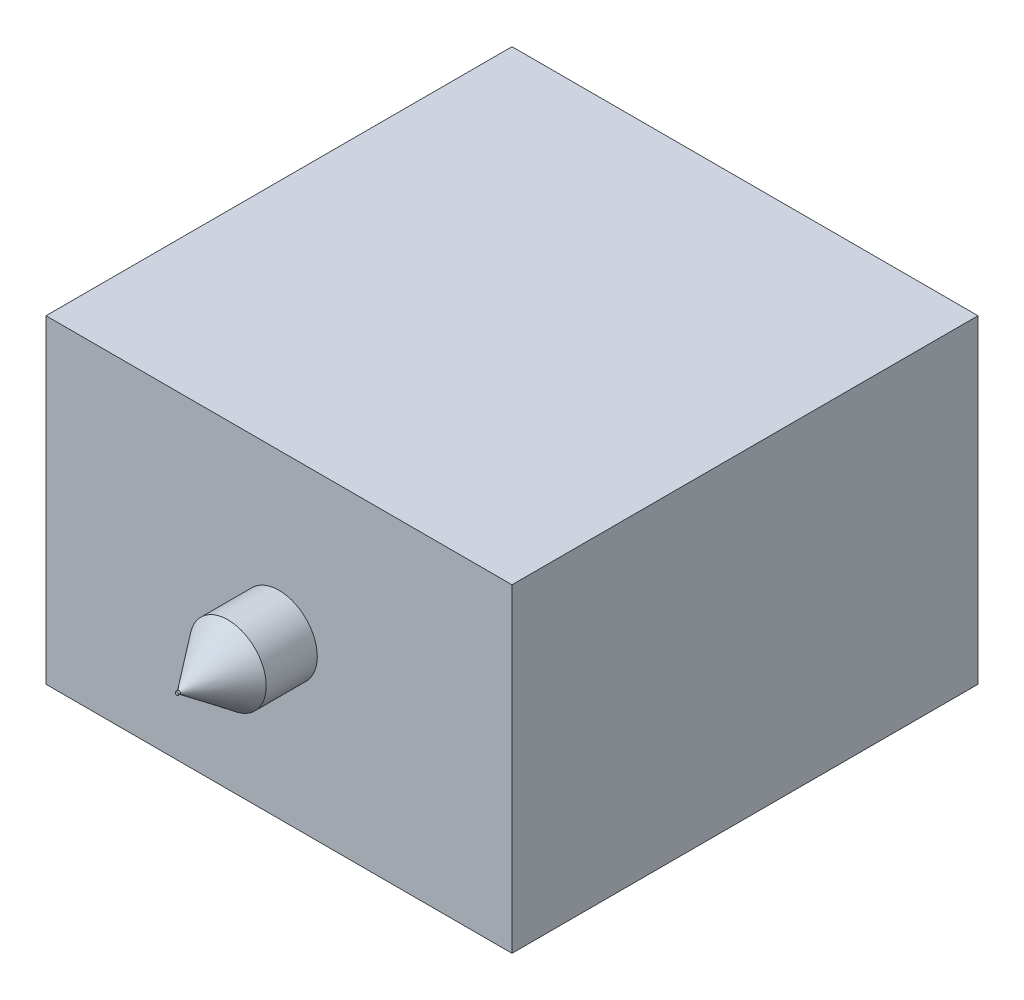
ISO-10303-21;
HEADER;
FILE_DESCRIPTION(('STEP AP214'),'2;1');
FILE_NAME('part.step','',(''),(''),'','','');
FILE_SCHEMA(('AUTOMOTIVE_DESIGN { 1 0 10303 214 1 1 1 1 }'));
ENDSEC;
DATA;
#1=APPLICATION_CONTEXT('core data for automotive mechanical design processes');
#2=APPLICATION_PROTOCOL_DEFINITION('international standard','automotive_design',2000,#1);
#3=PRODUCT_CONTEXT('',#1,'mechanical');
#4=PRODUCT('Part','Part','',(#3));
#5=PRODUCT_RELATED_PRODUCT_CATEGORY('part','',(#4));
#6=PRODUCT_DEFINITION_FORMATION('','',#4);
#7=PRODUCT_DEFINITION_CONTEXT('part definition',#1,'design');
#8=PRODUCT_DEFINITION('design','',#6,#7);
#9=PRODUCT_DEFINITION_SHAPE('','',#8);
#10=(LENGTH_UNIT() NAMED_UNIT(*) SI_UNIT(.MILLI.,.METRE.));
#11=(NAMED_UNIT(*) PLANE_ANGLE_UNIT() SI_UNIT($,.RADIAN.));
#12=(NAMED_UNIT(*) SI_UNIT($,.STERADIAN.) SOLID_ANGLE_UNIT());
#13=UNCERTAINTY_MEASURE_WITH_UNIT(LENGTH_MEASURE(1.E-05),#10,'distance_accuracy_value','');
#14=(GEOMETRIC_REPRESENTATION_CONTEXT(3) GLOBAL_UNCERTAINTY_ASSIGNED_CONTEXT((#13)) GLOBAL_UNIT_ASSIGNED_CONTEXT((#10,
#11,#12)) REPRESENTATION_CONTEXT('',''));
#15=CARTESIAN_POINT('',(0.,0.,0.));
#16=DIRECTION('',(0.,0.,1.));
#17=DIRECTION('',(1.,0.,0.));
#18=AXIS2_PLACEMENT_3D('',#15,#16,#17);
#19=CARTESIAN_POINT('',(0.,0.,457.2));
#20=DIRECTION('',(1.,0.,0.));
#21=DIRECTION('',(0.,0.,-1.));
#22=AXIS2_PLACEMENT_3D('',#19,#20,#21);
#23=PLANE('',#22);
#24=DIRECTION('',(0.,-1.,0.));
#25=VECTOR('',#24,1.);
#26=CARTESIAN_POINT('',(0.,0.,0.));
#27=LINE('',#26,#25);
#28=CARTESIAN_POINT('',(0.,311.15,0.));
#29=VERTEX_POINT('',#28);
#30=CARTESIAN_POINT('',(0.,-6.35,0.));
#31=VERTEX_POINT('',#30);
#32=EDGE_CURVE('E61',#29,#31,#27,.T.);
#33=ORIENTED_EDGE('',*,*,#32,.T.);
#34=DIRECTION('',(0.,0.,-1.));
#35=VECTOR('',#34,1.);
#36=CARTESIAN_POINT('',(0.,-6.35,0.));
#37=LINE('',#36,#35);
#38=CARTESIAN_POINT('',(0.,-6.35,463.55));
#39=VERTEX_POINT('',#38);
#40=EDGE_CURVE('E100',#39,#31,#37,.T.);
#41=ORIENTED_EDGE('',*,*,#40,.F.);
#42=DIRECTION('',(0.,-1.,0.));
#43=VECTOR('',#42,1.);
#44=CARTESIAN_POINT('',(0.,311.15,463.55));
#45=LINE('',#44,#43);
#46=CARTESIAN_POINT('',(0.,311.15,463.55));
#47=VERTEX_POINT('',#46);
#48=EDGE_CURVE('E98',#47,#39,#45,.T.);
#49=ORIENTED_EDGE('',*,*,#48,.F.);
#50=DIRECTION('',(0.,0.,1.));
#51=VECTOR('',#50,1.);
#52=CARTESIAN_POINT('',(0.,311.15,0.));
#53=LINE('',#52,#51);
#54=EDGE_CURVE('E85',#29,#47,#53,.T.);
#55=ORIENTED_EDGE('',*,*,#54,.F.);
#56=EDGE_LOOP('',(#33,#41,#49,#55));
#57=FACE_BOUND('',#56,.T.);
#58=ADVANCED_FACE('F43',(#57),#23,.F.);
#59=CARTESIAN_POINT('',(0.,0.,0.));
#60=DIRECTION('',(0.,0.,-1.));
#61=DIRECTION('',(-1.,0.,0.));
#62=AXIS2_PLACEMENT_3D('',#59,#60,#61);
#63=PLANE('',#62);
#64=CARTESIAN_POINT('',(231.775,152.4,0.));
#65=DIRECTION('',(0.,0.,-1.));
#66=DIRECTION('',(-1.,0.,0.));
#67=AXIS2_PLACEMENT_3D('',#64,#65,#66);
#68=CIRCLE('',#67,50.8);
#69=CARTESIAN_POINT('',(180.975,152.4,0.));
#70=VERTEX_POINT('',#69);
#71=EDGE_CURVE('E51',#70,#70,#68,.T.);
#72=ORIENTED_EDGE('',*,*,#71,.F.);
#73=EDGE_LOOP('',(#72));
#74=FACE_BOUND('',#73,.T.);
#75=ORIENTED_EDGE('',*,*,#32,.F.);
#76=DIRECTION('',(-1.,0.,0.));
#77=VECTOR('',#76,1.);
#78=CARTESIAN_POINT('',(0.,311.15,0.));
#79=LINE('',#78,#77);
#80=CARTESIAN_POINT('',(463.55,311.15,0.));
#81=VERTEX_POINT('',#80);
#82=EDGE_CURVE('E91',#81,#29,#79,.T.);
#83=ORIENTED_EDGE('',*,*,#82,.F.);
#84=DIRECTION('',(0.,1.,0.));
#85=VECTOR('',#84,1.);
#86=CARTESIAN_POINT('',(463.55,0.,0.));
#87=LINE('',#86,#85);
#88=CARTESIAN_POINT('',(463.55,-6.35,0.));
#89=VERTEX_POINT('',#88);
#90=EDGE_CURVE('E136',#89,#81,#87,.T.);
#91=ORIENTED_EDGE('',*,*,#90,.F.);
#92=DIRECTION('',(1.,0.,0.));
#93=VECTOR('',#92,1.);
#94=CARTESIAN_POINT('',(0.,-6.35,0.));
#95=LINE('',#94,#93);
#96=EDGE_CURVE('E126',#31,#89,#95,.T.);
#97=ORIENTED_EDGE('',*,*,#96,.F.);
#98=EDGE_LOOP('',(#75,#83,#91,#97));
#99=FACE_BOUND('',#98,.T.);
#100=ADVANCED_FACE('F176',(#74,#99),#63,.T.);
#101=CARTESIAN_POINT('',(463.55,0.,0.));
#102=DIRECTION('',(1.,0.,0.));
#103=DIRECTION('',(0.,0.,-1.));
#104=AXIS2_PLACEMENT_3D('',#101,#102,#103);
#105=PLANE('',#104);
#106=ORIENTED_EDGE('',*,*,#90,.T.);
#107=DIRECTION('',(0.,0.,-1.));
#108=VECTOR('',#107,1.);
#109=CARTESIAN_POINT('',(463.55,311.15,0.));
#110=LINE('',#109,#108);
#111=CARTESIAN_POINT('',(463.55,311.15,463.55));
#112=VERTEX_POINT('',#111);
#113=EDGE_CURVE('E94',#112,#81,#110,.T.);
#114=ORIENTED_EDGE('',*,*,#113,.F.);
#115=DIRECTION('',(0.,1.,0.));
#116=VECTOR('',#115,1.);
#117=CARTESIAN_POINT('',(463.55,-6.35,463.55));
#118=LINE('',#117,#116);
#119=CARTESIAN_POINT('',(463.55,-6.35,463.55));
#120=VERTEX_POINT('',#119);
#121=EDGE_CURVE('E110',#120,#112,#118,.T.);
#122=ORIENTED_EDGE('',*,*,#121,.F.);
#123=DIRECTION('',(0.,0.,1.));
#124=VECTOR('',#123,1.);
#125=CARTESIAN_POINT('',(463.55,-6.35,0.));
#126=LINE('',#125,#124);
#127=EDGE_CURVE('E95',#89,#120,#126,.T.);
#128=ORIENTED_EDGE('',*,*,#127,.F.);
#129=EDGE_LOOP('',(#106,#114,#122,#128));
#130=FACE_BOUND('',#129,.T.);
#131=ADVANCED_FACE('F180',(#130),#105,.T.);
#132=CARTESIAN_POINT('',(0.,311.15,0.));
#133=DIRECTION('',(0.,1.,0.));
#134=DIRECTION('',(0.,0.,1.));
#135=AXIS2_PLACEMENT_3D('',#132,#133,#134);
#136=PLANE('',#135);
#137=ORIENTED_EDGE('',*,*,#54,.T.);
#138=DIRECTION('',(-1.,0.,0.));
#139=VECTOR('',#138,1.);
#140=CARTESIAN_POINT('',(463.55,311.15,463.55));
#141=LINE('',#140,#139);
#142=EDGE_CURVE('E90',#112,#47,#141,.T.);
#143=ORIENTED_EDGE('',*,*,#142,.F.);
#144=ORIENTED_EDGE('',*,*,#113,.T.);
#145=ORIENTED_EDGE('',*,*,#82,.T.);
#146=EDGE_LOOP('',(#137,#143,#144,#145));
#147=FACE_BOUND('',#146,.T.);
#148=ADVANCED_FACE('F87',(#147),#136,.T.);
#149=CARTESIAN_POINT('',(0.,-6.35,0.));
#150=DIRECTION('',(0.,1.,0.));
#151=DIRECTION('',(0.,0.,1.));
#152=AXIS2_PLACEMENT_3D('',#149,#150,#151);
#153=PLANE('',#152);
#154=ORIENTED_EDGE('',*,*,#40,.T.);
#155=ORIENTED_EDGE('',*,*,#96,.T.);
#156=ORIENTED_EDGE('',*,*,#127,.T.);
#157=DIRECTION('',(1.,0.,0.));
#158=VECTOR('',#157,1.);
#159=CARTESIAN_POINT('',(0.,-6.35,463.55));
#160=LINE('',#159,#158);
#161=EDGE_CURVE('E105',#39,#120,#160,.T.);
#162=ORIENTED_EDGE('',*,*,#161,.F.);
#163=EDGE_LOOP('',(#154,#155,#156,#162));
#164=FACE_BOUND('',#163,.T.);
#165=ADVANCED_FACE('F190',(#164),#153,.F.);
#166=CARTESIAN_POINT('',(0.,0.,463.55));
#167=DIRECTION('',(0.,0.,1.));
#168=DIRECTION('',(1.,0.,0.));
#169=AXIS2_PLACEMENT_3D('',#166,#167,#168);
#170=PLANE('',#169);
#171=CARTESIAN_POINT('',(231.775,152.4,463.55));
#172=DIRECTION('',(0.,0.,1.));
#173=DIRECTION('',(1.,0.,0.));
#174=AXIS2_PLACEMENT_3D('',#171,#172,#173);
#175=CIRCLE('',#174,38.1);
#176=CARTESIAN_POINT('',(269.875,152.4,463.55));
#177=VERTEX_POINT('',#176);
#178=EDGE_CURVE('E116',#177,#177,#175,.T.);
#179=ORIENTED_EDGE('',*,*,#178,.F.);
#180=EDGE_LOOP('',(#179));
#181=FACE_BOUND('',#180,.T.);
#182=ORIENTED_EDGE('',*,*,#142,.T.);
#183=ORIENTED_EDGE('',*,*,#48,.T.);
#184=ORIENTED_EDGE('',*,*,#161,.T.);
#185=ORIENTED_EDGE('',*,*,#121,.T.);
#186=EDGE_LOOP('',(#182,#183,#184,#185));
#187=FACE_BOUND('',#186,.T.);
#188=ADVANCED_FACE('F108',(#181,#187),#170,.T.);
#189=CARTESIAN_POINT('',(231.775,152.4,514.35));
#190=DIRECTION('',(0.,0.,-1.));
#191=DIRECTION('',(-1.,0.,0.));
#192=AXIS2_PLACEMENT_3D('',#189,#190,#191);
#193=CYLINDRICAL_SURFACE('',#192,38.1);
#194=CARTESIAN_POINT('',(231.775,152.4,514.35));
#195=DIRECTION('',(0.,0.,1.));
#196=DIRECTION('',(1.,0.,0.));
#197=AXIS2_PLACEMENT_3D('',#194,#195,#196);
#198=CIRCLE('',#197,38.1);
#199=CARTESIAN_POINT('',(269.875,152.4,514.35));
#200=VERTEX_POINT('',#199);
#201=EDGE_CURVE('E112',#200,#200,#198,.T.);
#202=ORIENTED_EDGE('',*,*,#201,.F.);
#203=EDGE_LOOP('',(#202));
#204=FACE_BOUND('',#203,.T.);
#205=ORIENTED_EDGE('',*,*,#178,.T.);
#206=EDGE_LOOP('',(#205));
#207=FACE_BOUND('',#206,.T.);
#208=ADVANCED_FACE('F196',(#204,#207),#193,.T.);
#209=CARTESIAN_POINT('',(231.775,152.4,-25.4));
#210=DIRECTION('',(0.,0.,1.));
#211=DIRECTION('',(1.,0.,0.));
#212=AXIS2_PLACEMENT_3D('',#209,#210,#211);
#213=CYLINDRICAL_SURFACE('',#212,50.8);
#214=CARTESIAN_POINT('',(231.775,152.4,-25.4));
#215=DIRECTION('',(0.,0.,-1.));
#216=DIRECTION('',(-1.,0.,0.));
#217=AXIS2_PLACEMENT_3D('',#214,#215,#216);
#218=CIRCLE('',#217,50.8);
#219=CARTESIAN_POINT('',(180.975,152.4,-25.4));
#220=VERTEX_POINT('',#219);
#221=EDGE_CURVE('E145',#220,#220,#218,.T.);
#222=ORIENTED_EDGE('',*,*,#221,.F.);
#223=EDGE_LOOP('',(#222));
#224=FACE_BOUND('',#223,.T.);
#225=ORIENTED_EDGE('',*,*,#71,.T.);
#226=EDGE_LOOP('',(#225));
#227=FACE_BOUND('',#226,.T.);
#228=ADVANCED_FACE('F172',(#224,#227),#213,.T.);
#229=CARTESIAN_POINT('',(231.775,152.4,-25.4));
#230=DIRECTION('',(0.,0.,-1.));
#231=DIRECTION('',(-1.,0.,0.));
#232=AXIS2_PLACEMENT_3D('',#229,#230,#231);
#233=PLANE('',#232);
#234=ORIENTED_EDGE('',*,*,#221,.T.);
#235=EDGE_LOOP('',(#234));
#236=FACE_BOUND('',#235,.T.);
#237=ADVANCED_FACE('F164',(#236),#233,.T.);
#238=CARTESIAN_POINT('',(231.775,152.4,565.15));
#239=DIRECTION('',(0.,0.,-1.));
#240=DIRECTION('',(-1.,0.,0.));
#241=AXIS2_PLACEMENT_3D('',#238,#239,#240);
#242=CONICAL_SURFACE('',#241,0.,0.643501108793285);
#243=ORIENTED_EDGE('',*,*,#201,.T.);
#244=EDGE_LOOP('',(#243));
#245=FACE_BOUND('',#244,.T.);
#246=CARTESIAN_POINT('',(231.775,152.4,563.033333333333));
#247=DIRECTION('',(0.,0.,-1.));
#248=DIRECTION('',(-1.,0.,0.));
#249=AXIS2_PLACEMENT_3D('',#246,#247,#248);
#250=CIRCLE('',#249,1.58749999999999);
#251=CARTESIAN_POINT('',(230.1875,152.4,563.033333333333));
#252=VERTEX_POINT('',#251);
#253=EDGE_CURVE('E11',#252,#252,#250,.T.);
#254=ORIENTED_EDGE('',*,*,#253,.T.);
#255=EDGE_LOOP('',(#254));
#256=FACE_BOUND('',#255,.T.);
#257=ADVANCED_FACE('F162',(#245,#256),#242,.T.);
#258=CARTESIAN_POINT('',(231.775,152.4,565.15));
#259=DIRECTION('',(0.,0.,1.));
#260=DIRECTION('',(1.,0.,0.));
#261=AXIS2_PLACEMENT_3D('',#258,#259,#260);
#262=PLANE('',#261);
#263=CARTESIAN_POINT('',(231.775,152.4,565.15));
#264=VERTEX_POINT('',#263);
#265=VERTEX_LOOP('',#264);
#266=FACE_BOUND('',#265,.T.);
#267=CARTESIAN_POINT('',(231.775,152.4,565.15));
#268=DIRECTION('',(0.,0.,1.));
#269=DIRECTION('',(1.,0.,0.));
#270=AXIS2_PLACEMENT_3D('',#267,#268,#269);
#271=CIRCLE('',#270,1.58749999999999);
#272=CARTESIAN_POINT('',(233.3625,152.4,565.15));
#273=VERTEX_POINT('',#272);
#274=EDGE_CURVE('E149',#273,#273,#271,.T.);
#275=ORIENTED_EDGE('',*,*,#274,.T.);
#276=EDGE_LOOP('',(#275));
#277=FACE_BOUND('',#276,.T.);
#278=ADVANCED_FACE('F154',(#266,#277),#262,.T.);
#279=CARTESIAN_POINT('',(231.775,152.4,565.15));
#280=DIRECTION('',(0.,0.,-1.));
#281=DIRECTION('',(-1.,0.,0.));
#282=AXIS2_PLACEMENT_3D('',#279,#280,#281);
#283=CYLINDRICAL_SURFACE('',#282,1.58749999999999);
#284=ORIENTED_EDGE('',*,*,#274,.F.);
#285=EDGE_LOOP('',(#284));
#286=FACE_BOUND('',#285,.T.);
#287=ORIENTED_EDGE('',*,*,#253,.F.);
#288=EDGE_LOOP('',(#287));
#289=FACE_BOUND('',#288,.T.);
#290=ADVANCED_FACE('F156',(#286,#289),#283,.T.);
#291=CLOSED_SHELL('',(#58,#100,#131,#148,#165,#188,#208,#228,#237,#257,#278,#290));
#292=MANIFOLD_SOLID_BREP('B2',#291);
#293=ADVANCED_BREP_SHAPE_REPRESENTATION('',(#18,#292),#14);
#294=SHAPE_DEFINITION_REPRESENTATION(#9,#293);
ENDSEC;
END-ISO-10303-21;
